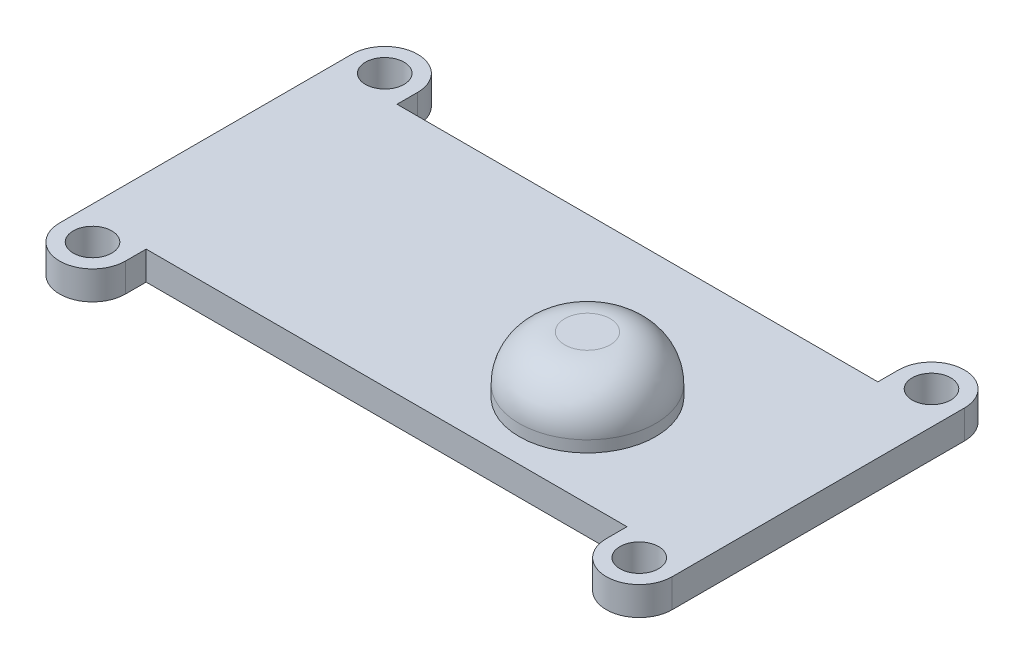
ISO-10303-21;
HEADER;
FILE_DESCRIPTION(('STEP AP214'),'2;1');
FILE_NAME('part.step','',(''),(''),'','','');
FILE_SCHEMA(('AUTOMOTIVE_DESIGN { 1 0 10303 214 1 1 1 1 }'));
ENDSEC;
DATA;
#1=APPLICATION_CONTEXT('core data for automotive mechanical design processes');
#2=APPLICATION_PROTOCOL_DEFINITION('international standard','automotive_design',2000,#1);
#3=PRODUCT_CONTEXT('',#1,'mechanical');
#4=PRODUCT('Part','Part','',(#3));
#5=PRODUCT_RELATED_PRODUCT_CATEGORY('part','',(#4));
#6=PRODUCT_DEFINITION_FORMATION('','',#4);
#7=PRODUCT_DEFINITION_CONTEXT('part definition',#1,'design');
#8=PRODUCT_DEFINITION('design','',#6,#7);
#9=PRODUCT_DEFINITION_SHAPE('','',#8);
#10=(LENGTH_UNIT() NAMED_UNIT(*) SI_UNIT(.MILLI.,.METRE.));
#11=(NAMED_UNIT(*) PLANE_ANGLE_UNIT() SI_UNIT($,.RADIAN.));
#12=(NAMED_UNIT(*) SI_UNIT($,.STERADIAN.) SOLID_ANGLE_UNIT());
#13=UNCERTAINTY_MEASURE_WITH_UNIT(LENGTH_MEASURE(1.E-05),#10,'distance_accuracy_value','');
#14=(GEOMETRIC_REPRESENTATION_CONTEXT(3) GLOBAL_UNCERTAINTY_ASSIGNED_CONTEXT((#13)) GLOBAL_UNIT_ASSIGNED_CONTEXT((#10,
#11,#12)) REPRESENTATION_CONTEXT('',''));
#15=CARTESIAN_POINT('',(0.,0.,0.));
#16=DIRECTION('',(0.,0.,1.));
#17=DIRECTION('',(1.,0.,0.));
#18=AXIS2_PLACEMENT_3D('',#15,#16,#17);
#19=CARTESIAN_POINT('',(15.2781,0.8001,-8.1661));
#20=DIRECTION('',(0.,1.,0.));
#21=DIRECTION('',(0.,0.,1.));
#22=AXIS2_PLACEMENT_3D('',#19,#20,#21);
#23=PLANE('',#22);
#24=CARTESIAN_POINT('',(6.0706,0.8001,1.8542));
#25=DIRECTION('',(0.,1.,0.));
#26=DIRECTION('',(0.,0.,1.));
#27=AXIS2_PLACEMENT_3D('',#24,#25,#26);
#28=CIRCLE('',#27,3.81);
#29=CARTESIAN_POINT('',(6.0706,0.8001,5.6642));
#30=VERTEX_POINT('',#29);
#31=EDGE_CURVE('E334',#30,#30,#28,.T.);
#32=ORIENTED_EDGE('',*,*,#31,.F.);
#33=EDGE_LOOP('',(#32));
#34=FACE_BOUND('',#33,.T.);
#35=CARTESIAN_POINT('',(15.2781,0.8001,-8.1661));
#36=DIRECTION('',(0.,1.,0.));
#37=DIRECTION('',(0.,0.,-1.));
#38=AXIS2_PLACEMENT_3D('',#35,#36,#37);
#39=CIRCLE('',#38,1.0795);
#40=CARTESIAN_POINT('',(15.2781,0.8001,-9.2456));
#41=VERTEX_POINT('',#40);
#42=EDGE_CURVE('E322',#41,#41,#39,.T.);
#43=ORIENTED_EDGE('',*,*,#42,.F.);
#44=EDGE_LOOP('',(#43));
#45=FACE_BOUND('',#44,.T.);
#46=CARTESIAN_POINT('',(-15.2781,0.8001,-8.1661));
#47=DIRECTION('',(0.,1.,0.));
#48=DIRECTION('',(0.,0.,1.));
#49=AXIS2_PLACEMENT_3D('',#46,#47,#48);
#50=CIRCLE('',#49,1.0795);
#51=CARTESIAN_POINT('',(-15.2781,0.8001,-7.0866));
#52=VERTEX_POINT('',#51);
#53=EDGE_CURVE('E165',#52,#52,#50,.T.);
#54=ORIENTED_EDGE('',*,*,#53,.F.);
#55=EDGE_LOOP('',(#54));
#56=FACE_BOUND('',#55,.T.);
#57=DIRECTION('',(0.,0.,-1.));
#58=VECTOR('',#57,1.);
#59=CARTESIAN_POINT('',(17.1196,0.8001,-7.0104));
#60=LINE('',#59,#58);
#61=CARTESIAN_POINT('',(17.1196,0.8001,8.1661));
#62=VERTEX_POINT('',#61);
#63=CARTESIAN_POINT('',(17.1196,0.8001,-8.1661));
#64=VERTEX_POINT('',#63);
#65=EDGE_CURVE('E52',#62,#64,#60,.T.);
#66=ORIENTED_EDGE('',*,*,#65,.T.);
#67=CARTESIAN_POINT('',(15.2781,0.8001,-8.1661));
#68=DIRECTION('',(0.,1.,0.));
#69=DIRECTION('',(0.,0.,1.));
#70=AXIS2_PLACEMENT_3D('',#67,#68,#69);
#71=CIRCLE('',#70,1.8415);
#72=CARTESIAN_POINT('',(13.4366,0.8001,-8.1661));
#73=VERTEX_POINT('',#72);
#74=EDGE_CURVE('E110',#64,#73,#71,.T.);
#75=ORIENTED_EDGE('',*,*,#74,.T.);
#76=DIRECTION('',(0.,0.,1.));
#77=VECTOR('',#76,1.);
#78=CARTESIAN_POINT('',(13.4366,0.8001,-8.1661));
#79=LINE('',#78,#77);
#80=CARTESIAN_POINT('',(13.4366,0.8001,-7.0104));
#81=VERTEX_POINT('',#80);
#82=EDGE_CURVE('E282',#73,#81,#79,.T.);
#83=ORIENTED_EDGE('',*,*,#82,.T.);
#84=DIRECTION('',(-1.,0.,0.));
#85=VECTOR('',#84,1.);
#86=CARTESIAN_POINT('',(-13.4366,0.8001,-7.0104));
#87=LINE('',#86,#85);
#88=CARTESIAN_POINT('',(-13.4366,0.8001,-7.0104));
#89=VERTEX_POINT('',#88);
#90=EDGE_CURVE('E294',#81,#89,#87,.T.);
#91=ORIENTED_EDGE('',*,*,#90,.T.);
#92=DIRECTION('',(0.,0.,-1.));
#93=VECTOR('',#92,1.);
#94=CARTESIAN_POINT('',(-13.4366,0.8001,-8.1661));
#95=LINE('',#94,#93);
#96=CARTESIAN_POINT('',(-13.4366,0.8001,-8.1661));
#97=VERTEX_POINT('',#96);
#98=EDGE_CURVE('E291',#89,#97,#95,.T.);
#99=ORIENTED_EDGE('',*,*,#98,.T.);
#100=CARTESIAN_POINT('',(-15.2781,0.8001,-8.1661));
#101=DIRECTION('',(0.,1.,0.));
#102=DIRECTION('',(0.,0.,-1.));
#103=AXIS2_PLACEMENT_3D('',#100,#101,#102);
#104=CIRCLE('',#103,1.8415);
#105=CARTESIAN_POINT('',(-17.1196,0.8001,-8.1661));
#106=VERTEX_POINT('',#105);
#107=EDGE_CURVE('E293',#97,#106,#104,.T.);
#108=ORIENTED_EDGE('',*,*,#107,.T.);
#109=DIRECTION('',(0.,0.,1.));
#110=VECTOR('',#109,1.);
#111=CARTESIAN_POINT('',(-17.1196,0.8001,-7.0104));
#112=LINE('',#111,#110);
#113=CARTESIAN_POINT('',(-17.1196,0.8001,8.1661));
#114=VERTEX_POINT('',#113);
#115=EDGE_CURVE('E296',#106,#114,#112,.T.);
#116=ORIENTED_EDGE('',*,*,#115,.T.);
#117=CARTESIAN_POINT('',(-15.2781,0.8001,8.1661));
#118=DIRECTION('',(0.,1.,0.));
#119=DIRECTION('',(0.,0.,1.));
#120=AXIS2_PLACEMENT_3D('',#117,#118,#119);
#121=CIRCLE('',#120,1.8415);
#122=CARTESIAN_POINT('',(-13.4366,0.8001,8.1661));
#123=VERTEX_POINT('',#122);
#124=EDGE_CURVE('E302',#114,#123,#121,.T.);
#125=ORIENTED_EDGE('',*,*,#124,.T.);
#126=DIRECTION('',(0.,0.,-1.));
#127=VECTOR('',#126,1.);
#128=CARTESIAN_POINT('',(-13.4366,0.8001,8.1661));
#129=LINE('',#128,#127);
#130=CARTESIAN_POINT('',(-13.4366,0.8001,7.0104));
#131=VERTEX_POINT('',#130);
#132=EDGE_CURVE('E142',#123,#131,#129,.T.);
#133=ORIENTED_EDGE('',*,*,#132,.T.);
#134=DIRECTION('',(1.,0.,0.));
#135=VECTOR('',#134,1.);
#136=CARTESIAN_POINT('',(-13.4366,0.8001,7.0104));
#137=LINE('',#136,#135);
#138=CARTESIAN_POINT('',(13.4366,0.8001,7.0104));
#139=VERTEX_POINT('',#138);
#140=EDGE_CURVE('E136',#131,#139,#137,.T.);
#141=ORIENTED_EDGE('',*,*,#140,.T.);
#142=DIRECTION('',(0.,0.,1.));
#143=VECTOR('',#142,1.);
#144=CARTESIAN_POINT('',(13.4366,0.8001,8.1661));
#145=LINE('',#144,#143);
#146=CARTESIAN_POINT('',(13.4366,0.8001,8.1661));
#147=VERTEX_POINT('',#146);
#148=EDGE_CURVE('E140',#139,#147,#145,.T.);
#149=ORIENTED_EDGE('',*,*,#148,.T.);
#150=CARTESIAN_POINT('',(15.2781,0.8001,8.1661));
#151=DIRECTION('',(0.,1.,0.));
#152=DIRECTION('',(0.,0.,-1.));
#153=AXIS2_PLACEMENT_3D('',#150,#151,#152);
#154=CIRCLE('',#153,1.8415);
#155=EDGE_CURVE('E156',#147,#62,#154,.T.);
#156=ORIENTED_EDGE('',*,*,#155,.T.);
#157=EDGE_LOOP('',(#66,#75,#83,#91,#99,#108,#116,#125,#133,#141,#149,#156));
#158=FACE_BOUND('',#157,.T.);
#159=CARTESIAN_POINT('',(-15.2781,0.8001,8.1661));
#160=DIRECTION('',(0.,1.,0.));
#161=DIRECTION('',(0.,0.,-1.));
#162=AXIS2_PLACEMENT_3D('',#159,#160,#161);
#163=CIRCLE('',#162,1.0795);
#164=CARTESIAN_POINT('',(-15.2781,0.8001,7.0866));
#165=VERTEX_POINT('',#164);
#166=EDGE_CURVE('E316',#165,#165,#163,.T.);
#167=ORIENTED_EDGE('',*,*,#166,.F.);
#168=EDGE_LOOP('',(#167));
#169=FACE_BOUND('',#168,.T.);
#170=CARTESIAN_POINT('',(15.2781,0.8001,8.1661));
#171=DIRECTION('',(0.,1.,0.));
#172=DIRECTION('',(0.,0.,1.));
#173=AXIS2_PLACEMENT_3D('',#170,#171,#172);
#174=CIRCLE('',#173,1.0795);
#175=CARTESIAN_POINT('',(15.2781,0.8001,9.2456));
#176=VERTEX_POINT('',#175);
#177=EDGE_CURVE('E328',#176,#176,#174,.T.);
#178=ORIENTED_EDGE('',*,*,#177,.F.);
#179=EDGE_LOOP('',(#178));
#180=FACE_BOUND('',#179,.T.);
#181=ADVANCED_FACE('F35',(#34,#45,#56,#158,#169,#180),#23,.T.);
#182=CARTESIAN_POINT('',(15.2781,-0.8001,-8.1661));
#183=DIRECTION('',(0.,1.,0.));
#184=DIRECTION('',(0.,0.,1.));
#185=AXIS2_PLACEMENT_3D('',#182,#183,#184);
#186=PLANE('',#185);
#187=CARTESIAN_POINT('',(15.2781,-0.8001,-8.1661));
#188=DIRECTION('',(0.,1.,0.));
#189=DIRECTION('',(0.,0.,1.));
#190=AXIS2_PLACEMENT_3D('',#187,#188,#189);
#191=CIRCLE('',#190,1.8415);
#192=CARTESIAN_POINT('',(17.1196,-0.8001,-8.1661));
#193=VERTEX_POINT('',#192);
#194=CARTESIAN_POINT('',(13.4366,-0.8001,-8.1661));
#195=VERTEX_POINT('',#194);
#196=EDGE_CURVE('E162',#193,#195,#191,.T.);
#197=ORIENTED_EDGE('',*,*,#196,.F.);
#198=DIRECTION('',(0.,0.,-1.));
#199=VECTOR('',#198,1.);
#200=CARTESIAN_POINT('',(17.1196,-0.8001,7.0104));
#201=LINE('',#200,#199);
#202=CARTESIAN_POINT('',(17.1196,-0.8001,8.1661));
#203=VERTEX_POINT('',#202);
#204=EDGE_CURVE('E101',#203,#193,#201,.T.);
#205=ORIENTED_EDGE('',*,*,#204,.F.);
#206=CARTESIAN_POINT('',(15.2781,-0.8001,8.1661));
#207=DIRECTION('',(0.,1.,0.));
#208=DIRECTION('',(0.,0.,-1.));
#209=AXIS2_PLACEMENT_3D('',#206,#207,#208);
#210=CIRCLE('',#209,1.8415);
#211=CARTESIAN_POINT('',(13.4366,-0.8001,8.1661));
#212=VERTEX_POINT('',#211);
#213=EDGE_CURVE('E182',#212,#203,#210,.T.);
#214=ORIENTED_EDGE('',*,*,#213,.F.);
#215=DIRECTION('',(0.,0.,1.));
#216=VECTOR('',#215,1.);
#217=CARTESIAN_POINT('',(13.4366,-0.8001,8.1661));
#218=LINE('',#217,#216);
#219=CARTESIAN_POINT('',(13.4366,-0.8001,7.0104));
#220=VERTEX_POINT('',#219);
#221=EDGE_CURVE('E94',#220,#212,#218,.T.);
#222=ORIENTED_EDGE('',*,*,#221,.F.);
#223=DIRECTION('',(1.,0.,0.));
#224=VECTOR('',#223,1.);
#225=CARTESIAN_POINT('',(-13.4366,-0.8001,7.0104));
#226=LINE('',#225,#224);
#227=CARTESIAN_POINT('',(-13.4366,-0.8001,7.0104));
#228=VERTEX_POINT('',#227);
#229=EDGE_CURVE('E150',#228,#220,#226,.T.);
#230=ORIENTED_EDGE('',*,*,#229,.F.);
#231=DIRECTION('',(0.,0.,-1.));
#232=VECTOR('',#231,1.);
#233=CARTESIAN_POINT('',(-13.4366,-0.8001,8.1661));
#234=LINE('',#233,#232);
#235=CARTESIAN_POINT('',(-13.4366,-0.8001,8.1661));
#236=VERTEX_POINT('',#235);
#237=EDGE_CURVE('E178',#236,#228,#234,.T.);
#238=ORIENTED_EDGE('',*,*,#237,.F.);
#239=CARTESIAN_POINT('',(-15.2781,-0.8001,8.1661));
#240=DIRECTION('',(0.,1.,0.));
#241=DIRECTION('',(0.,0.,1.));
#242=AXIS2_PLACEMENT_3D('',#239,#240,#241);
#243=CIRCLE('',#242,1.8415);
#244=CARTESIAN_POINT('',(-17.1196,-0.8001,8.1661));
#245=VERTEX_POINT('',#244);
#246=EDGE_CURVE('E176',#245,#236,#243,.T.);
#247=ORIENTED_EDGE('',*,*,#246,.F.);
#248=DIRECTION('',(0.,0.,1.));
#249=VECTOR('',#248,1.);
#250=CARTESIAN_POINT('',(-17.1196,-0.8001,7.0104));
#251=LINE('',#250,#249);
#252=CARTESIAN_POINT('',(-17.1196,-0.8001,-8.1661));
#253=VERTEX_POINT('',#252);
#254=EDGE_CURVE('E174',#253,#245,#251,.T.);
#255=ORIENTED_EDGE('',*,*,#254,.F.);
#256=CARTESIAN_POINT('',(-15.2781,-0.8001,-8.1661));
#257=DIRECTION('',(0.,1.,0.));
#258=DIRECTION('',(0.,0.,-1.));
#259=AXIS2_PLACEMENT_3D('',#256,#257,#258);
#260=CIRCLE('',#259,1.8415);
#261=CARTESIAN_POINT('',(-13.4366,-0.8001,-8.1661));
#262=VERTEX_POINT('',#261);
#263=EDGE_CURVE('E171',#262,#253,#260,.T.);
#264=ORIENTED_EDGE('',*,*,#263,.F.);
#265=DIRECTION('',(0.,0.,-1.));
#266=VECTOR('',#265,1.);
#267=CARTESIAN_POINT('',(-13.4366,-0.8001,-8.1661));
#268=LINE('',#267,#266);
#269=CARTESIAN_POINT('',(-13.4366,-0.8001,-7.0104));
#270=VERTEX_POINT('',#269);
#271=EDGE_CURVE('E169',#270,#262,#268,.T.);
#272=ORIENTED_EDGE('',*,*,#271,.F.);
#273=DIRECTION('',(-1.,0.,0.));
#274=VECTOR('',#273,1.);
#275=CARTESIAN_POINT('',(-13.4366,-0.8001,-7.0104));
#276=LINE('',#275,#274);
#277=CARTESIAN_POINT('',(13.4366,-0.8001,-7.0104));
#278=VERTEX_POINT('',#277);
#279=EDGE_CURVE('E167',#278,#270,#276,.T.);
#280=ORIENTED_EDGE('',*,*,#279,.F.);
#281=DIRECTION('',(0.,0.,1.));
#282=VECTOR('',#281,1.);
#283=CARTESIAN_POINT('',(13.4366,-0.8001,-8.1661));
#284=LINE('',#283,#282);
#285=EDGE_CURVE('E164',#195,#278,#284,.T.);
#286=ORIENTED_EDGE('',*,*,#285,.F.);
#287=EDGE_LOOP('',(#197,#205,#214,#222,#230,#238,#247,#255,#264,#272,#280,#286));
#288=FACE_BOUND('',#287,.T.);
#289=CARTESIAN_POINT('',(-15.2781,-0.8001,-8.1661));
#290=DIRECTION('',(0.,1.,0.));
#291=DIRECTION('',(0.,0.,1.));
#292=AXIS2_PLACEMENT_3D('',#289,#290,#291);
#293=CIRCLE('',#292,1.0795);
#294=CARTESIAN_POINT('',(-15.2781,-0.8001,-7.0866));
#295=VERTEX_POINT('',#294);
#296=EDGE_CURVE('E313',#295,#295,#293,.T.);
#297=ORIENTED_EDGE('',*,*,#296,.T.);
#298=EDGE_LOOP('',(#297));
#299=FACE_BOUND('',#298,.T.);
#300=CARTESIAN_POINT('',(-15.2781,-0.8001,8.1661));
#301=DIRECTION('',(0.,1.,0.));
#302=DIRECTION('',(0.,0.,-1.));
#303=AXIS2_PLACEMENT_3D('',#300,#301,#302);
#304=CIRCLE('',#303,1.0795);
#305=CARTESIAN_POINT('',(-15.2781,-0.8001,7.0866));
#306=VERTEX_POINT('',#305);
#307=EDGE_CURVE('E319',#306,#306,#304,.T.);
#308=ORIENTED_EDGE('',*,*,#307,.T.);
#309=EDGE_LOOP('',(#308));
#310=FACE_BOUND('',#309,.T.);
#311=CARTESIAN_POINT('',(15.2781,-0.8001,-8.1661));
#312=DIRECTION('',(0.,1.,0.));
#313=DIRECTION('',(0.,0.,-1.));
#314=AXIS2_PLACEMENT_3D('',#311,#312,#313);
#315=CIRCLE('',#314,1.0795);
#316=CARTESIAN_POINT('',(15.2781,-0.8001,-9.2456));
#317=VERTEX_POINT('',#316);
#318=EDGE_CURVE('E325',#317,#317,#315,.T.);
#319=ORIENTED_EDGE('',*,*,#318,.T.);
#320=EDGE_LOOP('',(#319));
#321=FACE_BOUND('',#320,.T.);
#322=CARTESIAN_POINT('',(15.2781,-0.8001,8.1661));
#323=DIRECTION('',(0.,1.,0.));
#324=DIRECTION('',(0.,0.,1.));
#325=AXIS2_PLACEMENT_3D('',#322,#323,#324);
#326=CIRCLE('',#325,1.0795);
#327=CARTESIAN_POINT('',(15.2781,-0.8001,9.2456));
#328=VERTEX_POINT('',#327);
#329=EDGE_CURVE('E331',#328,#328,#326,.T.);
#330=ORIENTED_EDGE('',*,*,#329,.T.);
#331=EDGE_LOOP('',(#330));
#332=FACE_BOUND('',#331,.T.);
#333=ADVANCED_FACE('F224',(#288,#299,#310,#321,#332),#186,.F.);
#334=CARTESIAN_POINT('',(15.2781,0.8001,-8.1661));
#335=DIRECTION('',(0.,-1.,0.));
#336=DIRECTION('',(0.,0.,-1.));
#337=AXIS2_PLACEMENT_3D('',#334,#335,#336);
#338=CYLINDRICAL_SURFACE('',#337,1.8415);
#339=ORIENTED_EDGE('',*,*,#196,.T.);
#340=DIRECTION('',(0.,-1.,0.));
#341=VECTOR('',#340,1.);
#342=CARTESIAN_POINT('',(13.4366,0.8001,-8.1661));
#343=LINE('',#342,#341);
#344=EDGE_CURVE('E206',#73,#195,#343,.T.);
#345=ORIENTED_EDGE('',*,*,#344,.F.);
#346=ORIENTED_EDGE('',*,*,#74,.F.);
#347=DIRECTION('',(0.,-1.,0.));
#348=VECTOR('',#347,1.);
#349=CARTESIAN_POINT('',(17.1196,0.8001,-8.1661));
#350=LINE('',#349,#348);
#351=EDGE_CURVE('E209',#64,#193,#350,.T.);
#352=ORIENTED_EDGE('',*,*,#351,.T.);
#353=EDGE_LOOP('',(#339,#345,#346,#352));
#354=FACE_BOUND('',#353,.T.);
#355=ADVANCED_FACE('F230',(#354),#338,.T.);
#356=CARTESIAN_POINT('',(13.4366,0.8001,-8.1661));
#357=DIRECTION('',(1.,0.,0.));
#358=DIRECTION('',(0.,0.,-1.));
#359=AXIS2_PLACEMENT_3D('',#356,#357,#358);
#360=PLANE('',#359);
#361=ORIENTED_EDGE('',*,*,#285,.T.);
#362=DIRECTION('',(0.,-1.,0.));
#363=VECTOR('',#362,1.);
#364=CARTESIAN_POINT('',(13.4366,0.8001,-7.0104));
#365=LINE('',#364,#363);
#366=EDGE_CURVE('E203',#81,#278,#365,.T.);
#367=ORIENTED_EDGE('',*,*,#366,.F.);
#368=ORIENTED_EDGE('',*,*,#82,.F.);
#369=ORIENTED_EDGE('',*,*,#344,.T.);
#370=EDGE_LOOP('',(#361,#367,#368,#369));
#371=FACE_BOUND('',#370,.T.);
#372=ADVANCED_FACE('F272',(#371),#360,.F.);
#373=CARTESIAN_POINT('',(-13.4366,0.8001,-7.0104));
#374=DIRECTION('',(0.,0.,1.));
#375=DIRECTION('',(1.,0.,0.));
#376=AXIS2_PLACEMENT_3D('',#373,#374,#375);
#377=PLANE('',#376);
#378=ORIENTED_EDGE('',*,*,#279,.T.);
#379=DIRECTION('',(0.,-1.,0.));
#380=VECTOR('',#379,1.);
#381=CARTESIAN_POINT('',(-13.4366,0.8001,-7.0104));
#382=LINE('',#381,#380);
#383=EDGE_CURVE('E200',#89,#270,#382,.T.);
#384=ORIENTED_EDGE('',*,*,#383,.F.);
#385=ORIENTED_EDGE('',*,*,#90,.F.);
#386=ORIENTED_EDGE('',*,*,#366,.T.);
#387=EDGE_LOOP('',(#378,#384,#385,#386));
#388=FACE_BOUND('',#387,.T.);
#389=ADVANCED_FACE('F268',(#388),#377,.F.);
#390=CARTESIAN_POINT('',(-13.4366,0.8001,-8.1661));
#391=DIRECTION('',(-1.,0.,0.));
#392=DIRECTION('',(0.,0.,1.));
#393=AXIS2_PLACEMENT_3D('',#390,#391,#392);
#394=PLANE('',#393);
#395=ORIENTED_EDGE('',*,*,#271,.T.);
#396=DIRECTION('',(0.,-1.,0.));
#397=VECTOR('',#396,1.);
#398=CARTESIAN_POINT('',(-13.4366,0.8001,-8.1661));
#399=LINE('',#398,#397);
#400=EDGE_CURVE('E197',#97,#262,#399,.T.);
#401=ORIENTED_EDGE('',*,*,#400,.F.);
#402=ORIENTED_EDGE('',*,*,#98,.F.);
#403=ORIENTED_EDGE('',*,*,#383,.T.);
#404=EDGE_LOOP('',(#395,#401,#402,#403));
#405=FACE_BOUND('',#404,.T.);
#406=ADVANCED_FACE('F264',(#405),#394,.F.);
#407=CARTESIAN_POINT('',(-15.2781,0.8001,-8.1661));
#408=DIRECTION('',(0.,-1.,0.));
#409=DIRECTION('',(0.,0.,-1.));
#410=AXIS2_PLACEMENT_3D('',#407,#408,#409);
#411=CYLINDRICAL_SURFACE('',#410,1.8415);
#412=ORIENTED_EDGE('',*,*,#263,.T.);
#413=DIRECTION('',(0.,-1.,0.));
#414=VECTOR('',#413,1.);
#415=CARTESIAN_POINT('',(-17.1196,0.8001,-8.1661));
#416=LINE('',#415,#414);
#417=EDGE_CURVE('E194',#106,#253,#416,.T.);
#418=ORIENTED_EDGE('',*,*,#417,.F.);
#419=ORIENTED_EDGE('',*,*,#107,.F.);
#420=ORIENTED_EDGE('',*,*,#400,.T.);
#421=EDGE_LOOP('',(#412,#418,#419,#420));
#422=FACE_BOUND('',#421,.T.);
#423=ADVANCED_FACE('F260',(#422),#411,.T.);
#424=CARTESIAN_POINT('',(-17.1196,0.8001,7.0104));
#425=DIRECTION('',(1.,0.,0.));
#426=DIRECTION('',(0.,0.,-1.));
#427=AXIS2_PLACEMENT_3D('',#424,#425,#426);
#428=PLANE('',#427);
#429=ORIENTED_EDGE('',*,*,#254,.T.);
#430=DIRECTION('',(0.,-1.,0.));
#431=VECTOR('',#430,1.);
#432=CARTESIAN_POINT('',(-17.1196,0.8001,8.1661));
#433=LINE('',#432,#431);
#434=EDGE_CURVE('E191',#114,#245,#433,.T.);
#435=ORIENTED_EDGE('',*,*,#434,.F.);
#436=ORIENTED_EDGE('',*,*,#115,.F.);
#437=ORIENTED_EDGE('',*,*,#417,.T.);
#438=EDGE_LOOP('',(#429,#435,#436,#437));
#439=FACE_BOUND('',#438,.T.);
#440=ADVANCED_FACE('F256',(#439),#428,.F.);
#441=CARTESIAN_POINT('',(-15.2781,0.8001,8.1661));
#442=DIRECTION('',(0.,-1.,0.));
#443=DIRECTION('',(0.,0.,-1.));
#444=AXIS2_PLACEMENT_3D('',#441,#442,#443);
#445=CYLINDRICAL_SURFACE('',#444,1.8415);
#446=ORIENTED_EDGE('',*,*,#246,.T.);
#447=DIRECTION('',(0.,-1.,0.));
#448=VECTOR('',#447,1.);
#449=CARTESIAN_POINT('',(-13.4366,0.8001,8.1661));
#450=LINE('',#449,#448);
#451=EDGE_CURVE('E188',#123,#236,#450,.T.);
#452=ORIENTED_EDGE('',*,*,#451,.F.);
#453=ORIENTED_EDGE('',*,*,#124,.F.);
#454=ORIENTED_EDGE('',*,*,#434,.T.);
#455=EDGE_LOOP('',(#446,#452,#453,#454));
#456=FACE_BOUND('',#455,.T.);
#457=ADVANCED_FACE('F252',(#456),#445,.T.);
#458=CARTESIAN_POINT('',(-13.4366,0.8001,8.1661));
#459=DIRECTION('',(-1.,0.,0.));
#460=DIRECTION('',(0.,0.,1.));
#461=AXIS2_PLACEMENT_3D('',#458,#459,#460);
#462=PLANE('',#461);
#463=ORIENTED_EDGE('',*,*,#237,.T.);
#464=DIRECTION('',(0.,-1.,0.));
#465=VECTOR('',#464,1.);
#466=CARTESIAN_POINT('',(-13.4366,0.8001,7.0104));
#467=LINE('',#466,#465);
#468=EDGE_CURVE('E151',#131,#228,#467,.T.);
#469=ORIENTED_EDGE('',*,*,#468,.F.);
#470=ORIENTED_EDGE('',*,*,#132,.F.);
#471=ORIENTED_EDGE('',*,*,#451,.T.);
#472=EDGE_LOOP('',(#463,#469,#470,#471));
#473=FACE_BOUND('',#472,.T.);
#474=ADVANCED_FACE('F249',(#473),#462,.F.);
#475=CARTESIAN_POINT('',(-13.4366,0.8001,7.0104));
#476=DIRECTION('',(0.,0.,-1.));
#477=DIRECTION('',(-1.,0.,0.));
#478=AXIS2_PLACEMENT_3D('',#475,#476,#477);
#479=PLANE('',#478);
#480=ORIENTED_EDGE('',*,*,#229,.T.);
#481=DIRECTION('',(0.,-1.,0.));
#482=VECTOR('',#481,1.);
#483=CARTESIAN_POINT('',(13.4366,0.8001,7.0104));
#484=LINE('',#483,#482);
#485=EDGE_CURVE('E147',#139,#220,#484,.T.);
#486=ORIENTED_EDGE('',*,*,#485,.F.);
#487=ORIENTED_EDGE('',*,*,#140,.F.);
#488=ORIENTED_EDGE('',*,*,#468,.T.);
#489=EDGE_LOOP('',(#480,#486,#487,#488));
#490=FACE_BOUND('',#489,.T.);
#491=ADVANCED_FACE('F148',(#490),#479,.F.);
#492=CARTESIAN_POINT('',(13.4366,0.8001,8.1661));
#493=DIRECTION('',(1.,0.,0.));
#494=DIRECTION('',(0.,0.,-1.));
#495=AXIS2_PLACEMENT_3D('',#492,#493,#494);
#496=PLANE('',#495);
#497=ORIENTED_EDGE('',*,*,#221,.T.);
#498=DIRECTION('',(0.,-1.,0.));
#499=VECTOR('',#498,1.);
#500=CARTESIAN_POINT('',(13.4366,0.8001,8.1661));
#501=LINE('',#500,#499);
#502=EDGE_CURVE('E152',#147,#212,#501,.T.);
#503=ORIENTED_EDGE('',*,*,#502,.F.);
#504=ORIENTED_EDGE('',*,*,#148,.F.);
#505=ORIENTED_EDGE('',*,*,#485,.T.);
#506=EDGE_LOOP('',(#497,#503,#504,#505));
#507=FACE_BOUND('',#506,.T.);
#508=ADVANCED_FACE('F154',(#507),#496,.F.);
#509=CARTESIAN_POINT('',(15.2781,0.8001,8.1661));
#510=DIRECTION('',(0.,-1.,0.));
#511=DIRECTION('',(0.,0.,-1.));
#512=AXIS2_PLACEMENT_3D('',#509,#510,#511);
#513=CYLINDRICAL_SURFACE('',#512,1.8415);
#514=ORIENTED_EDGE('',*,*,#213,.T.);
#515=DIRECTION('',(0.,-1.,0.));
#516=VECTOR('',#515,1.);
#517=CARTESIAN_POINT('',(17.1196,0.8001,8.1661));
#518=LINE('',#517,#516);
#519=EDGE_CURVE('E158',#62,#203,#518,.T.);
#520=ORIENTED_EDGE('',*,*,#519,.F.);
#521=ORIENTED_EDGE('',*,*,#155,.F.);
#522=ORIENTED_EDGE('',*,*,#502,.T.);
#523=EDGE_LOOP('',(#514,#520,#521,#522));
#524=FACE_BOUND('',#523,.T.);
#525=ADVANCED_FACE('F241',(#524),#513,.T.);
#526=CARTESIAN_POINT('',(17.1196,0.8001,7.0104));
#527=DIRECTION('',(-1.,0.,0.));
#528=DIRECTION('',(0.,0.,1.));
#529=AXIS2_PLACEMENT_3D('',#526,#527,#528);
#530=PLANE('',#529);
#531=ORIENTED_EDGE('',*,*,#204,.T.);
#532=ORIENTED_EDGE('',*,*,#351,.F.);
#533=ORIENTED_EDGE('',*,*,#65,.F.);
#534=ORIENTED_EDGE('',*,*,#519,.T.);
#535=EDGE_LOOP('',(#531,#532,#533,#534));
#536=FACE_BOUND('',#535,.T.);
#537=ADVANCED_FACE('F238',(#536),#530,.F.);
#538=CARTESIAN_POINT('',(-15.2781,0.8001,-8.1661));
#539=DIRECTION('',(0.,-1.,0.));
#540=DIRECTION('',(0.,0.,-1.));
#541=AXIS2_PLACEMENT_3D('',#538,#539,#540);
#542=CYLINDRICAL_SURFACE('',#541,1.0795);
#543=ORIENTED_EDGE('',*,*,#53,.T.);
#544=EDGE_LOOP('',(#543));
#545=FACE_BOUND('',#544,.T.);
#546=ORIENTED_EDGE('',*,*,#296,.F.);
#547=EDGE_LOOP('',(#546));
#548=FACE_BOUND('',#547,.T.);
#549=ADVANCED_FACE('F235',(#545,#548),#542,.F.);
#550=CARTESIAN_POINT('',(-15.2781,0.8001,8.1661));
#551=DIRECTION('',(0.,-1.,0.));
#552=DIRECTION('',(0.,0.,-1.));
#553=AXIS2_PLACEMENT_3D('',#550,#551,#552);
#554=CYLINDRICAL_SURFACE('',#553,1.0795);
#555=ORIENTED_EDGE('',*,*,#166,.T.);
#556=EDGE_LOOP('',(#555));
#557=FACE_BOUND('',#556,.T.);
#558=ORIENTED_EDGE('',*,*,#307,.F.);
#559=EDGE_LOOP('',(#558));
#560=FACE_BOUND('',#559,.T.);
#561=ADVANCED_FACE('F351',(#557,#560),#554,.F.);
#562=CARTESIAN_POINT('',(15.2781,0.8001,-8.1661));
#563=DIRECTION('',(0.,-1.,0.));
#564=DIRECTION('',(0.,0.,-1.));
#565=AXIS2_PLACEMENT_3D('',#562,#563,#564);
#566=CYLINDRICAL_SURFACE('',#565,1.0795);
#567=ORIENTED_EDGE('',*,*,#42,.T.);
#568=EDGE_LOOP('',(#567));
#569=FACE_BOUND('',#568,.T.);
#570=ORIENTED_EDGE('',*,*,#318,.F.);
#571=EDGE_LOOP('',(#570));
#572=FACE_BOUND('',#571,.T.);
#573=ADVANCED_FACE('F346',(#569,#572),#566,.F.);
#574=CARTESIAN_POINT('',(15.2781,0.8001,8.1661));
#575=DIRECTION('',(0.,-1.,0.));
#576=DIRECTION('',(0.,0.,-1.));
#577=AXIS2_PLACEMENT_3D('',#574,#575,#576);
#578=CYLINDRICAL_SURFACE('',#577,1.0795);
#579=ORIENTED_EDGE('',*,*,#177,.T.);
#580=EDGE_LOOP('',(#579));
#581=FACE_BOUND('',#580,.T.);
#582=ORIENTED_EDGE('',*,*,#329,.F.);
#583=EDGE_LOOP('',(#582));
#584=FACE_BOUND('',#583,.T.);
#585=ADVANCED_FACE('F340',(#581,#584),#578,.F.);
#586=CARTESIAN_POINT('',(6.0706,3.9751,1.8542));
#587=DIRECTION('',(0.,-1.,0.));
#588=DIRECTION('',(0.,0.,-1.));
#589=AXIS2_PLACEMENT_3D('',#586,#587,#588);
#590=CYLINDRICAL_SURFACE('',#589,3.81);
#591=CARTESIAN_POINT('',(6.0706,1.4351,1.8542));
#592=DIRECTION('',(0.,1.,0.));
#593=DIRECTION('',(0.,0.,1.));
#594=AXIS2_PLACEMENT_3D('',#591,#592,#593);
#595=CIRCLE('',#594,3.81);
#596=CARTESIAN_POINT('',(6.0706,1.4351,5.6642));
#597=VERTEX_POINT('',#596);
#598=EDGE_CURVE('E11',#597,#597,#595,.F.);
#599=ORIENTED_EDGE('',*,*,#598,.T.);
#600=EDGE_LOOP('',(#599));
#601=FACE_BOUND('',#600,.T.);
#602=ORIENTED_EDGE('',*,*,#31,.T.);
#603=EDGE_LOOP('',(#602));
#604=FACE_BOUND('',#603,.T.);
#605=ADVANCED_FACE('F220',(#601,#604),#590,.T.);
#606=CARTESIAN_POINT('',(6.0706,3.9751,1.8542));
#607=DIRECTION('',(0.,1.,0.));
#608=DIRECTION('',(0.,0.,1.));
#609=AXIS2_PLACEMENT_3D('',#606,#607,#608);
#610=PLANE('',#609);
#611=CARTESIAN_POINT('',(6.0706,3.9751,1.8542));
#612=DIRECTION('',(0.,1.,0.));
#613=DIRECTION('',(0.,0.,1.));
#614=AXIS2_PLACEMENT_3D('',#611,#612,#613);
#615=CIRCLE('',#614,1.27);
#616=CARTESIAN_POINT('',(6.0706,3.9751,3.1242));
#617=VERTEX_POINT('',#616);
#618=EDGE_CURVE('E44',#617,#617,#615,.T.);
#619=ORIENTED_EDGE('',*,*,#618,.T.);
#620=EDGE_LOOP('',(#619));
#621=FACE_BOUND('',#620,.T.);
#622=ADVANCED_FACE('F213',(#621),#610,.T.);
#623=CARTESIAN_POINT('',(6.0706,1.4351,1.8542));
#624=DIRECTION('',(0.,1.,0.));
#625=DIRECTION('',(0.,0.,1.));
#626=AXIS2_PLACEMENT_3D('',#623,#624,#625);
#627=DEGENERATE_TOROIDAL_SURFACE('',#626,1.27,2.54,.T.);
#628=ORIENTED_EDGE('',*,*,#598,.F.);
#629=EDGE_LOOP('',(#628));
#630=FACE_BOUND('',#629,.T.);
#631=ORIENTED_EDGE('',*,*,#618,.F.);
#632=EDGE_LOOP('',(#631));
#633=FACE_BOUND('',#632,.T.);
#634=ADVANCED_FACE('F37',(#630,#633),#627,.T.);
#635=CLOSED_SHELL('',(#181,#333,#355,#372,#389,#406,#423,#440,#457,#474,#491,#508,#525,#537,
#549,#561,#573,#585,#605,#622,#634));
#636=MANIFOLD_SOLID_BREP('B2',#635);
#637=ADVANCED_BREP_SHAPE_REPRESENTATION('',(#18,#636),#14);
#638=SHAPE_DEFINITION_REPRESENTATION(#9,#637);
ENDSEC;
END-ISO-10303-21;
